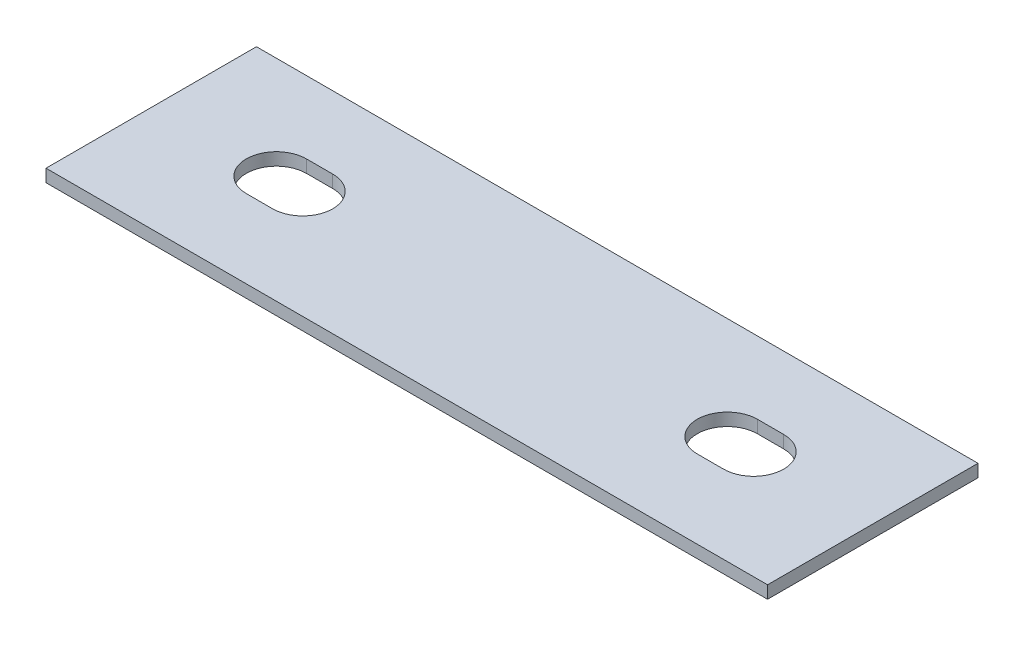
ISO-10303-21;
HEADER;
FILE_DESCRIPTION(('STEP AP214'),'2;1');
FILE_NAME('part.step','',(''),(''),'','','');
FILE_SCHEMA(('AUTOMOTIVE_DESIGN { 1 0 10303 214 1 1 1 1 }'));
ENDSEC;
DATA;
#1=APPLICATION_CONTEXT('core data for automotive mechanical design processes');
#2=APPLICATION_PROTOCOL_DEFINITION('international standard','automotive_design',2000,#1);
#3=PRODUCT_CONTEXT('',#1,'mechanical');
#4=PRODUCT('Part','Part','',(#3));
#5=PRODUCT_RELATED_PRODUCT_CATEGORY('part','',(#4));
#6=PRODUCT_DEFINITION_FORMATION('','',#4);
#7=PRODUCT_DEFINITION_CONTEXT('part definition',#1,'design');
#8=PRODUCT_DEFINITION('design','',#6,#7);
#9=PRODUCT_DEFINITION_SHAPE('','',#8);
#10=(LENGTH_UNIT() NAMED_UNIT(*) SI_UNIT(.MILLI.,.METRE.));
#11=(NAMED_UNIT(*) PLANE_ANGLE_UNIT() SI_UNIT($,.RADIAN.));
#12=(NAMED_UNIT(*) SI_UNIT($,.STERADIAN.) SOLID_ANGLE_UNIT());
#13=UNCERTAINTY_MEASURE_WITH_UNIT(LENGTH_MEASURE(1.E-05),#10,'distance_accuracy_value','');
#14=(GEOMETRIC_REPRESENTATION_CONTEXT(3) GLOBAL_UNCERTAINTY_ASSIGNED_CONTEXT((#13)) GLOBAL_UNIT_ASSIGNED_CONTEXT((#10,
#11,#12)) REPRESENTATION_CONTEXT('',''));
#15=CARTESIAN_POINT('',(0.,0.,0.));
#16=DIRECTION('',(0.,0.,1.));
#17=DIRECTION('',(1.,0.,0.));
#18=AXIS2_PLACEMENT_3D('',#15,#16,#17);
#19=CARTESIAN_POINT('',(0.,-2.65684,0.));
#20=DIRECTION('',(-1.,0.,0.));
#21=DIRECTION('',(0.,0.,1.));
#22=AXIS2_PLACEMENT_3D('',#19,#20,#21);
#23=PLANE('',#22);
#24=DIRECTION('',(0.,0.,1.));
#25=VECTOR('',#24,1.);
#26=CARTESIAN_POINT('',(0.,0.,0.));
#27=LINE('',#26,#25);
#28=CARTESIAN_POINT('',(0.,0.,-44.45));
#29=VERTEX_POINT('',#28);
#30=CARTESIAN_POINT('',(0.,0.,0.));
#31=VERTEX_POINT('',#30);
#32=EDGE_CURVE('E162',#29,#31,#27,.T.);
#33=ORIENTED_EDGE('',*,*,#32,.F.);
#34=DIRECTION('',(0.,1.,0.));
#35=VECTOR('',#34,1.);
#36=CARTESIAN_POINT('',(0.,-2.65684,-44.45));
#37=LINE('',#36,#35);
#38=CARTESIAN_POINT('',(0.,-2.65684,-44.45));
#39=VERTEX_POINT('',#38);
#40=EDGE_CURVE('E11',#39,#29,#37,.T.);
#41=ORIENTED_EDGE('',*,*,#40,.F.);
#42=DIRECTION('',(0.,0.,1.));
#43=VECTOR('',#42,1.);
#44=CARTESIAN_POINT('',(0.,-2.65684,0.));
#45=LINE('',#44,#43);
#46=CARTESIAN_POINT('',(0.,-2.65684,0.));
#47=VERTEX_POINT('',#46);
#48=EDGE_CURVE('E195',#39,#47,#45,.T.);
#49=ORIENTED_EDGE('',*,*,#48,.T.);
#50=DIRECTION('',(0.,1.,0.));
#51=VECTOR('',#50,1.);
#52=CARTESIAN_POINT('',(0.,-2.65684,0.));
#53=LINE('',#52,#51);
#54=EDGE_CURVE('E39',#47,#31,#53,.T.);
#55=ORIENTED_EDGE('',*,*,#54,.T.);
#56=EDGE_LOOP('',(#33,#41,#49,#55));
#57=FACE_BOUND('',#56,.T.);
#58=ADVANCED_FACE('F36',(#57),#23,.T.);
#59=CARTESIAN_POINT('',(0.,-2.65684,-44.45));
#60=DIRECTION('',(0.,0.,-1.));
#61=DIRECTION('',(-1.,0.,0.));
#62=AXIS2_PLACEMENT_3D('',#59,#60,#61);
#63=PLANE('',#62);
#64=DIRECTION('',(-1.,0.,0.));
#65=VECTOR('',#64,1.);
#66=CARTESIAN_POINT('',(0.,0.,-44.45));
#67=LINE('',#66,#65);
#68=CARTESIAN_POINT('',(152.4,0.,-44.45));
#69=VERTEX_POINT('',#68);
#70=EDGE_CURVE('E199',#69,#29,#67,.T.);
#71=ORIENTED_EDGE('',*,*,#70,.F.);
#72=DIRECTION('',(0.,1.,0.));
#73=VECTOR('',#72,1.);
#74=CARTESIAN_POINT('',(152.4,-2.65684,-44.45));
#75=LINE('',#74,#73);
#76=CARTESIAN_POINT('',(152.4,-2.65684,-44.45));
#77=VERTEX_POINT('',#76);
#78=EDGE_CURVE('E44',#77,#69,#75,.T.);
#79=ORIENTED_EDGE('',*,*,#78,.F.);
#80=DIRECTION('',(-1.,0.,0.));
#81=VECTOR('',#80,1.);
#82=CARTESIAN_POINT('',(0.,-2.65684,-44.45));
#83=LINE('',#82,#81);
#84=EDGE_CURVE('E205',#77,#39,#83,.T.);
#85=ORIENTED_EDGE('',*,*,#84,.T.);
#86=ORIENTED_EDGE('',*,*,#40,.T.);
#87=EDGE_LOOP('',(#71,#79,#85,#86));
#88=FACE_BOUND('',#87,.T.);
#89=ADVANCED_FACE('F230',(#88),#63,.T.);
#90=CARTESIAN_POINT('',(152.4,-2.65684,0.));
#91=DIRECTION('',(1.,0.,0.));
#92=DIRECTION('',(0.,0.,-1.));
#93=AXIS2_PLACEMENT_3D('',#90,#91,#92);
#94=PLANE('',#93);
#95=DIRECTION('',(0.,0.,-1.));
#96=VECTOR('',#95,1.);
#97=CARTESIAN_POINT('',(152.4,0.,0.));
#98=LINE('',#97,#96);
#99=CARTESIAN_POINT('',(152.4,0.,0.));
#100=VERTEX_POINT('',#99);
#101=EDGE_CURVE('E213',#100,#69,#98,.T.);
#102=ORIENTED_EDGE('',*,*,#101,.F.);
#103=DIRECTION('',(0.,1.,0.));
#104=VECTOR('',#103,1.);
#105=CARTESIAN_POINT('',(152.4,-2.65684,0.));
#106=LINE('',#105,#104);
#107=CARTESIAN_POINT('',(152.4,-2.65684,0.));
#108=VERTEX_POINT('',#107);
#109=EDGE_CURVE('E218',#108,#100,#106,.T.);
#110=ORIENTED_EDGE('',*,*,#109,.F.);
#111=DIRECTION('',(0.,0.,-1.));
#112=VECTOR('',#111,1.);
#113=CARTESIAN_POINT('',(152.4,-2.65684,0.));
#114=LINE('',#113,#112);
#115=EDGE_CURVE('E202',#108,#77,#114,.T.);
#116=ORIENTED_EDGE('',*,*,#115,.T.);
#117=ORIENTED_EDGE('',*,*,#78,.T.);
#118=EDGE_LOOP('',(#102,#110,#116,#117));
#119=FACE_BOUND('',#118,.T.);
#120=ADVANCED_FACE('F236',(#119),#94,.T.);
#121=CARTESIAN_POINT('',(0.,-2.65684,0.));
#122=DIRECTION('',(0.,0.,1.));
#123=DIRECTION('',(1.,0.,0.));
#124=AXIS2_PLACEMENT_3D('',#121,#122,#123);
#125=PLANE('',#124);
#126=DIRECTION('',(1.,0.,0.));
#127=VECTOR('',#126,1.);
#128=CARTESIAN_POINT('',(0.,0.,0.));
#129=LINE('',#128,#127);
#130=EDGE_CURVE('E210',#31,#100,#129,.T.);
#131=ORIENTED_EDGE('',*,*,#130,.F.);
#132=ORIENTED_EDGE('',*,*,#54,.F.);
#133=DIRECTION('',(1.,0.,0.));
#134=VECTOR('',#133,1.);
#135=CARTESIAN_POINT('',(0.,-2.65684,0.));
#136=LINE('',#135,#134);
#137=EDGE_CURVE('E198',#47,#108,#136,.T.);
#138=ORIENTED_EDGE('',*,*,#137,.T.);
#139=ORIENTED_EDGE('',*,*,#109,.T.);
#140=EDGE_LOOP('',(#131,#132,#138,#139));
#141=FACE_BOUND('',#140,.T.);
#142=ADVANCED_FACE('F226',(#141),#125,.T.);
#143=CARTESIAN_POINT('',(0.,-2.65684,0.));
#144=DIRECTION('',(0.,-1.,0.));
#145=DIRECTION('',(0.,0.,-1.));
#146=AXIS2_PLACEMENT_3D('',#143,#144,#145);
#147=PLANE('',#146);
#148=CARTESIAN_POINT('',(25.796875,-2.65684,-22.8600000000001));
#149=DIRECTION('',(0.,-1.,0.));
#150=DIRECTION('',(0.,0.,-1.));
#151=AXIS2_PLACEMENT_3D('',#148,#149,#150);
#152=CIRCLE('',#151,6.35000000000005);
#153=CARTESIAN_POINT('',(25.796875,-2.65684,-16.5100000000001));
#154=VERTEX_POINT('',#153);
#155=CARTESIAN_POINT('',(25.796875,-2.65684,-29.2100000000002));
#156=VERTEX_POINT('',#155);
#157=EDGE_CURVE('E52',#154,#156,#152,.T.);
#158=ORIENTED_EDGE('',*,*,#157,.F.);
#159=DIRECTION('',(-1.,0.,0.));
#160=VECTOR('',#159,1.);
#161=CARTESIAN_POINT('',(31.353125,-2.65684,-16.51));
#162=LINE('',#161,#160);
#163=CARTESIAN_POINT('',(31.353125,-2.65684,-16.51));
#164=VERTEX_POINT('',#163);
#165=EDGE_CURVE('E146',#164,#154,#162,.T.);
#166=ORIENTED_EDGE('',*,*,#165,.F.);
#167=CARTESIAN_POINT('',(31.353125,-2.65684,-22.86));
#168=DIRECTION('',(0.,-1.,0.));
#169=DIRECTION('',(0.,0.,-1.));
#170=AXIS2_PLACEMENT_3D('',#167,#168,#169);
#171=CIRCLE('',#170,6.35000000000007);
#172=CARTESIAN_POINT('',(31.353125,-2.65684,-29.2100000000001));
#173=VERTEX_POINT('',#172);
#174=EDGE_CURVE('E149',#173,#164,#171,.T.);
#175=ORIENTED_EDGE('',*,*,#174,.F.);
#176=DIRECTION('',(1.,0.,0.));
#177=VECTOR('',#176,1.);
#178=CARTESIAN_POINT('',(25.796875,-2.65684,-29.2100000000002));
#179=LINE('',#178,#177);
#180=EDGE_CURVE('E155',#156,#173,#179,.T.);
#181=ORIENTED_EDGE('',*,*,#180,.F.);
#182=EDGE_LOOP('',(#158,#166,#175,#181));
#183=FACE_BOUND('',#182,.T.);
#184=CARTESIAN_POINT('',(121.046875,-2.65684,-22.86));
#185=DIRECTION('',(0.,-1.,0.));
#186=DIRECTION('',(0.,0.,-1.));
#187=AXIS2_PLACEMENT_3D('',#184,#185,#186);
#188=CIRCLE('',#187,6.35000000000005);
#189=CARTESIAN_POINT('',(121.046875,-2.65684,-16.5100000000001));
#190=VERTEX_POINT('',#189);
#191=CARTESIAN_POINT('',(121.046875,-2.65684,-29.2100000000002));
#192=VERTEX_POINT('',#191);
#193=EDGE_CURVE('E60',#190,#192,#188,.T.);
#194=ORIENTED_EDGE('',*,*,#193,.F.);
#195=DIRECTION('',(-1.,0.,0.));
#196=VECTOR('',#195,1.);
#197=CARTESIAN_POINT('',(126.603125,-2.65684,-16.51));
#198=LINE('',#197,#196);
#199=CARTESIAN_POINT('',(126.603125,-2.65684,-16.51));
#200=VERTEX_POINT('',#199);
#201=EDGE_CURVE('E170',#200,#190,#198,.T.);
#202=ORIENTED_EDGE('',*,*,#201,.F.);
#203=CARTESIAN_POINT('',(126.603125,-2.65684,-22.86));
#204=DIRECTION('',(0.,-1.,0.));
#205=DIRECTION('',(0.,0.,-1.));
#206=AXIS2_PLACEMENT_3D('',#203,#204,#205);
#207=CIRCLE('',#206,6.35000000000008);
#208=CARTESIAN_POINT('',(126.603125,-2.65684,-29.2100000000001));
#209=VERTEX_POINT('',#208);
#210=EDGE_CURVE('E184',#209,#200,#207,.T.);
#211=ORIENTED_EDGE('',*,*,#210,.F.);
#212=DIRECTION('',(1.,0.,0.));
#213=VECTOR('',#212,1.);
#214=CARTESIAN_POINT('',(121.046875,-2.65684,-29.2100000000002));
#215=LINE('',#214,#213);
#216=EDGE_CURVE('E181',#192,#209,#215,.T.);
#217=ORIENTED_EDGE('',*,*,#216,.F.);
#218=EDGE_LOOP('',(#194,#202,#211,#217));
#219=FACE_BOUND('',#218,.T.);
#220=ORIENTED_EDGE('',*,*,#48,.F.);
#221=ORIENTED_EDGE('',*,*,#84,.F.);
#222=ORIENTED_EDGE('',*,*,#115,.F.);
#223=ORIENTED_EDGE('',*,*,#137,.F.);
#224=EDGE_LOOP('',(#220,#221,#222,#223));
#225=FACE_BOUND('',#224,.T.);
#226=ADVANCED_FACE('F233',(#183,#219,#225),#147,.T.);
#227=CARTESIAN_POINT('',(0.,0.,0.));
#228=DIRECTION('',(0.,-1.,0.));
#229=DIRECTION('',(0.,0.,-1.));
#230=AXIS2_PLACEMENT_3D('',#227,#228,#229);
#231=PLANE('',#230);
#232=DIRECTION('',(-1.,0.,0.));
#233=VECTOR('',#232,1.);
#234=CARTESIAN_POINT('',(31.353125,0.,-16.51));
#235=LINE('',#234,#233);
#236=CARTESIAN_POINT('',(31.353125,0.,-16.51));
#237=VERTEX_POINT('',#236);
#238=CARTESIAN_POINT('',(25.796875,0.,-16.5100000000001));
#239=VERTEX_POINT('',#238);
#240=EDGE_CURVE('E133',#237,#239,#235,.T.);
#241=ORIENTED_EDGE('',*,*,#240,.T.);
#242=CARTESIAN_POINT('',(25.796875,0.,-22.8600000000001));
#243=DIRECTION('',(0.,-1.,0.));
#244=DIRECTION('',(0.,0.,-1.));
#245=AXIS2_PLACEMENT_3D('',#242,#243,#244);
#246=CIRCLE('',#245,6.35000000000005);
#247=CARTESIAN_POINT('',(25.796875,0.,-29.2100000000002));
#248=VERTEX_POINT('',#247);
#249=EDGE_CURVE('E127',#239,#248,#246,.T.);
#250=ORIENTED_EDGE('',*,*,#249,.T.);
#251=DIRECTION('',(1.,0.,0.));
#252=VECTOR('',#251,1.);
#253=CARTESIAN_POINT('',(25.796875,0.,-29.2100000000002));
#254=LINE('',#253,#252);
#255=CARTESIAN_POINT('',(31.353125,0.,-29.2100000000002));
#256=VERTEX_POINT('',#255);
#257=EDGE_CURVE('E137',#248,#256,#254,.T.);
#258=ORIENTED_EDGE('',*,*,#257,.T.);
#259=CARTESIAN_POINT('',(31.353125,0.,-22.86));
#260=DIRECTION('',(0.,-1.,0.));
#261=DIRECTION('',(0.,0.,-1.));
#262=AXIS2_PLACEMENT_3D('',#259,#260,#261);
#263=CIRCLE('',#262,6.35000000000007);
#264=EDGE_CURVE('E141',#256,#237,#263,.T.);
#265=ORIENTED_EDGE('',*,*,#264,.T.);
#266=EDGE_LOOP('',(#241,#250,#258,#265));
#267=FACE_BOUND('',#266,.T.);
#268=DIRECTION('',(-1.,0.,0.));
#269=VECTOR('',#268,1.);
#270=CARTESIAN_POINT('',(126.603125,0.,-16.51));
#271=LINE('',#270,#269);
#272=CARTESIAN_POINT('',(126.603125,0.,-16.51));
#273=VERTEX_POINT('',#272);
#274=CARTESIAN_POINT('',(121.046875,0.,-16.5100000000001));
#275=VERTEX_POINT('',#274);
#276=EDGE_CURVE('E176',#273,#275,#271,.T.);
#277=ORIENTED_EDGE('',*,*,#276,.T.);
#278=CARTESIAN_POINT('',(121.046875,0.,-22.86));
#279=DIRECTION('',(0.,-1.,0.));
#280=DIRECTION('',(0.,0.,-1.));
#281=AXIS2_PLACEMENT_3D('',#278,#279,#280);
#282=CIRCLE('',#281,6.35000000000005);
#283=CARTESIAN_POINT('',(121.046875,0.,-29.2100000000002));
#284=VERTEX_POINT('',#283);
#285=EDGE_CURVE('E166',#275,#284,#282,.T.);
#286=ORIENTED_EDGE('',*,*,#285,.T.);
#287=DIRECTION('',(1.,0.,0.));
#288=VECTOR('',#287,1.);
#289=CARTESIAN_POINT('',(121.046875,0.,-29.2100000000002));
#290=LINE('',#289,#288);
#291=CARTESIAN_POINT('',(126.603125,0.,-29.2100000000002));
#292=VERTEX_POINT('',#291);
#293=EDGE_CURVE('E169',#284,#292,#290,.T.);
#294=ORIENTED_EDGE('',*,*,#293,.T.);
#295=CARTESIAN_POINT('',(126.603125,0.,-22.86));
#296=DIRECTION('',(0.,-1.,0.));
#297=DIRECTION('',(0.,0.,-1.));
#298=AXIS2_PLACEMENT_3D('',#295,#296,#297);
#299=CIRCLE('',#298,6.35000000000008);
#300=EDGE_CURVE('E173',#292,#273,#299,.T.);
#301=ORIENTED_EDGE('',*,*,#300,.T.);
#302=EDGE_LOOP('',(#277,#286,#294,#301));
#303=FACE_BOUND('',#302,.T.);
#304=ORIENTED_EDGE('',*,*,#32,.T.);
#305=ORIENTED_EDGE('',*,*,#130,.T.);
#306=ORIENTED_EDGE('',*,*,#101,.T.);
#307=ORIENTED_EDGE('',*,*,#70,.T.);
#308=EDGE_LOOP('',(#304,#305,#306,#307));
#309=FACE_BOUND('',#308,.T.);
#310=ADVANCED_FACE('F143',(#267,#303,#309),#231,.F.);
#311=CARTESIAN_POINT('',(121.046875,0.,-22.86));
#312=DIRECTION('',(0.,-1.,0.));
#313=DIRECTION('',(0.,0.,-1.));
#314=AXIS2_PLACEMENT_3D('',#311,#312,#313);
#315=CYLINDRICAL_SURFACE('',#314,6.35000000000005);
#316=ORIENTED_EDGE('',*,*,#193,.T.);
#317=DIRECTION('',(0.,-1.,0.));
#318=VECTOR('',#317,1.);
#319=CARTESIAN_POINT('',(121.046875,0.,-29.2100000000002));
#320=LINE('',#319,#318);
#321=EDGE_CURVE('E179',#284,#192,#320,.T.);
#322=ORIENTED_EDGE('',*,*,#321,.F.);
#323=ORIENTED_EDGE('',*,*,#285,.F.);
#324=DIRECTION('',(0.,-1.,0.));
#325=VECTOR('',#324,1.);
#326=CARTESIAN_POINT('',(121.046875,0.,-16.5100000000001));
#327=LINE('',#326,#325);
#328=EDGE_CURVE('E156',#275,#190,#327,.T.);
#329=ORIENTED_EDGE('',*,*,#328,.T.);
#330=EDGE_LOOP('',(#316,#322,#323,#329));
#331=FACE_BOUND('',#330,.T.);
#332=ADVANCED_FACE('F283',(#331),#315,.F.);
#333=CARTESIAN_POINT('',(126.603125,0.,-16.51));
#334=DIRECTION('',(0.,0.,1.));
#335=DIRECTION('',(1.,0.,0.));
#336=AXIS2_PLACEMENT_3D('',#333,#334,#335);
#337=PLANE('',#336);
#338=ORIENTED_EDGE('',*,*,#201,.T.);
#339=ORIENTED_EDGE('',*,*,#328,.F.);
#340=ORIENTED_EDGE('',*,*,#276,.F.);
#341=DIRECTION('',(0.,-1.,0.));
#342=VECTOR('',#341,1.);
#343=CARTESIAN_POINT('',(126.603125,0.,-16.51));
#344=LINE('',#343,#342);
#345=EDGE_CURVE('E190',#273,#200,#344,.T.);
#346=ORIENTED_EDGE('',*,*,#345,.T.);
#347=EDGE_LOOP('',(#338,#339,#340,#346));
#348=FACE_BOUND('',#347,.T.);
#349=ADVANCED_FACE('F293',(#348),#337,.F.);
#350=CARTESIAN_POINT('',(126.603125,0.,-22.86));
#351=DIRECTION('',(0.,-1.,0.));
#352=DIRECTION('',(0.,0.,-1.));
#353=AXIS2_PLACEMENT_3D('',#350,#351,#352);
#354=CYLINDRICAL_SURFACE('',#353,6.35000000000008);
#355=ORIENTED_EDGE('',*,*,#210,.T.);
#356=ORIENTED_EDGE('',*,*,#345,.F.);
#357=ORIENTED_EDGE('',*,*,#300,.F.);
#358=DIRECTION('',(0.,-1.,0.));
#359=VECTOR('',#358,1.);
#360=CARTESIAN_POINT('',(126.603125,0.,-29.2100000000001));
#361=LINE('',#360,#359);
#362=EDGE_CURVE('E192',#292,#209,#361,.T.);
#363=ORIENTED_EDGE('',*,*,#362,.T.);
#364=EDGE_LOOP('',(#355,#356,#357,#363));
#365=FACE_BOUND('',#364,.T.);
#366=ADVANCED_FACE('F303',(#365),#354,.F.);
#367=CARTESIAN_POINT('',(121.046875,0.,-29.2100000000002));
#368=DIRECTION('',(0.,0.,-1.));
#369=DIRECTION('',(-1.,0.,0.));
#370=AXIS2_PLACEMENT_3D('',#367,#368,#369);
#371=PLANE('',#370);
#372=ORIENTED_EDGE('',*,*,#216,.T.);
#373=ORIENTED_EDGE('',*,*,#362,.F.);
#374=ORIENTED_EDGE('',*,*,#293,.F.);
#375=ORIENTED_EDGE('',*,*,#321,.T.);
#376=EDGE_LOOP('',(#372,#373,#374,#375));
#377=FACE_BOUND('',#376,.T.);
#378=ADVANCED_FACE('F314',(#377),#371,.F.);
#379=CARTESIAN_POINT('',(25.796875,0.,-22.8600000000001));
#380=DIRECTION('',(0.,-1.,0.));
#381=DIRECTION('',(0.,0.,-1.));
#382=AXIS2_PLACEMENT_3D('',#379,#380,#381);
#383=CYLINDRICAL_SURFACE('',#382,6.35000000000005);
#384=ORIENTED_EDGE('',*,*,#157,.T.);
#385=DIRECTION('',(0.,-1.,0.));
#386=VECTOR('',#385,1.);
#387=CARTESIAN_POINT('',(25.796875,0.,-29.2100000000002));
#388=LINE('',#387,#386);
#389=EDGE_CURVE('E123',#248,#156,#388,.T.);
#390=ORIENTED_EDGE('',*,*,#389,.F.);
#391=ORIENTED_EDGE('',*,*,#249,.F.);
#392=DIRECTION('',(0.,-1.,0.));
#393=VECTOR('',#392,1.);
#394=CARTESIAN_POINT('',(25.796875,0.,-16.5100000000001));
#395=LINE('',#394,#393);
#396=EDGE_CURVE('E160',#239,#154,#395,.T.);
#397=ORIENTED_EDGE('',*,*,#396,.T.);
#398=EDGE_LOOP('',(#384,#390,#391,#397));
#399=FACE_BOUND('',#398,.T.);
#400=ADVANCED_FACE('F125',(#399),#383,.F.);
#401=CARTESIAN_POINT('',(31.353125,0.,-16.51));
#402=DIRECTION('',(0.,0.,1.));
#403=DIRECTION('',(1.,0.,0.));
#404=AXIS2_PLACEMENT_3D('',#401,#402,#403);
#405=PLANE('',#404);
#406=ORIENTED_EDGE('',*,*,#165,.T.);
#407=ORIENTED_EDGE('',*,*,#396,.F.);
#408=ORIENTED_EDGE('',*,*,#240,.F.);
#409=DIRECTION('',(0.,-1.,0.));
#410=VECTOR('',#409,1.);
#411=CARTESIAN_POINT('',(31.353125,0.,-16.51));
#412=LINE('',#411,#410);
#413=EDGE_CURVE('E163',#237,#164,#412,.T.);
#414=ORIENTED_EDGE('',*,*,#413,.T.);
#415=EDGE_LOOP('',(#406,#407,#408,#414));
#416=FACE_BOUND('',#415,.T.);
#417=ADVANCED_FACE('F335',(#416),#405,.F.);
#418=CARTESIAN_POINT('',(31.353125,0.,-22.86));
#419=DIRECTION('',(0.,-1.,0.));
#420=DIRECTION('',(0.,0.,-1.));
#421=AXIS2_PLACEMENT_3D('',#418,#419,#420);
#422=CYLINDRICAL_SURFACE('',#421,6.35000000000007);
#423=ORIENTED_EDGE('',*,*,#174,.T.);
#424=ORIENTED_EDGE('',*,*,#413,.F.);
#425=ORIENTED_EDGE('',*,*,#264,.F.);
#426=DIRECTION('',(0.,-1.,0.));
#427=VECTOR('',#426,1.);
#428=CARTESIAN_POINT('',(31.353125,0.,-29.2100000000001));
#429=LINE('',#428,#427);
#430=EDGE_CURVE('E132',#256,#173,#429,.T.);
#431=ORIENTED_EDGE('',*,*,#430,.T.);
#432=EDGE_LOOP('',(#423,#424,#425,#431));
#433=FACE_BOUND('',#432,.T.);
#434=ADVANCED_FACE('F345',(#433),#422,.F.);
#435=CARTESIAN_POINT('',(25.796875,0.,-29.2100000000002));
#436=DIRECTION('',(0.,0.,-1.));
#437=DIRECTION('',(-1.,0.,0.));
#438=AXIS2_PLACEMENT_3D('',#435,#436,#437);
#439=PLANE('',#438);
#440=ORIENTED_EDGE('',*,*,#180,.T.);
#441=ORIENTED_EDGE('',*,*,#430,.F.);
#442=ORIENTED_EDGE('',*,*,#257,.F.);
#443=ORIENTED_EDGE('',*,*,#389,.T.);
#444=EDGE_LOOP('',(#440,#441,#442,#443));
#445=FACE_BOUND('',#444,.T.);
#446=ADVANCED_FACE('F138',(#445),#439,.F.);
#447=CLOSED_SHELL('',(#58,#89,#120,#142,#226,#310,#332,#349,#366,#378,#400,#417,#434,#446));
#448=MANIFOLD_SOLID_BREP('B2',#447);
#449=ADVANCED_BREP_SHAPE_REPRESENTATION('',(#18,#448),#14);
#450=SHAPE_DEFINITION_REPRESENTATION(#9,#449);
ENDSEC;
END-ISO-10303-21;
